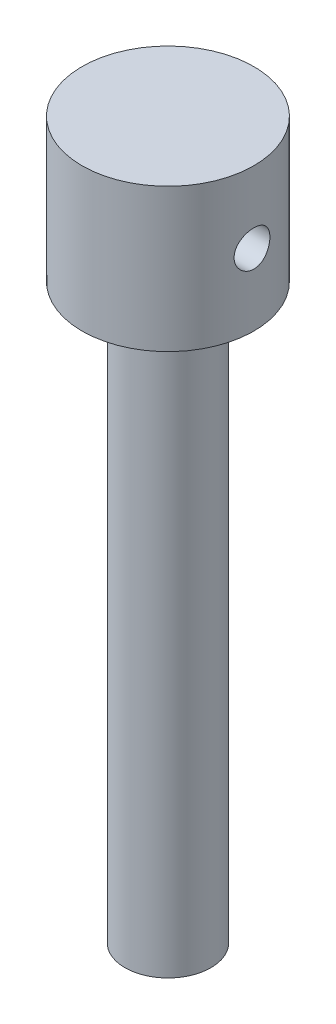
ISO-10303-21;
HEADER;
FILE_DESCRIPTION(('STEP AP214'),'2;1');
FILE_NAME('part.step','',(''),(''),'','','');
FILE_SCHEMA(('AUTOMOTIVE_DESIGN { 1 0 10303 214 1 1 1 1 }'));
ENDSEC;
DATA;
#1=APPLICATION_CONTEXT('core data for automotive mechanical design processes');
#2=APPLICATION_PROTOCOL_DEFINITION('international standard','automotive_design',2000,#1);
#3=PRODUCT_CONTEXT('',#1,'mechanical');
#4=PRODUCT('Part','Part','',(#3));
#5=PRODUCT_RELATED_PRODUCT_CATEGORY('part','',(#4));
#6=PRODUCT_DEFINITION_FORMATION('','',#4);
#7=PRODUCT_DEFINITION_CONTEXT('part definition',#1,'design');
#8=PRODUCT_DEFINITION('design','',#6,#7);
#9=PRODUCT_DEFINITION_SHAPE('','',#8);
#10=(LENGTH_UNIT() NAMED_UNIT(*) SI_UNIT(.MILLI.,.METRE.));
#11=(NAMED_UNIT(*) PLANE_ANGLE_UNIT() SI_UNIT($,.RADIAN.));
#12=(NAMED_UNIT(*) SI_UNIT($,.STERADIAN.) SOLID_ANGLE_UNIT());
#13=UNCERTAINTY_MEASURE_WITH_UNIT(LENGTH_MEASURE(1.E-05),#10,'distance_accuracy_value','');
#14=(GEOMETRIC_REPRESENTATION_CONTEXT(3) GLOBAL_UNCERTAINTY_ASSIGNED_CONTEXT((#13)) GLOBAL_UNIT_ASSIGNED_CONTEXT((#10,
#11,#12)) REPRESENTATION_CONTEXT('',''));
#15=CARTESIAN_POINT('',(0.,0.,0.));
#16=DIRECTION('',(0.,0.,1.));
#17=DIRECTION('',(1.,0.,0.));
#18=AXIS2_PLACEMENT_3D('',#15,#16,#17);
#19=CARTESIAN_POINT('',(0.,-2540.,0.));
#20=DIRECTION('',(0.,1.,0.));
#21=DIRECTION('',(0.,0.,1.));
#22=AXIS2_PLACEMENT_3D('',#19,#20,#21);
#23=CYLINDRICAL_SURFACE('',#22,152.4);
#24=CARTESIAN_POINT('',(0.,-2540.,0.));
#25=DIRECTION('',(0.,1.,0.));
#26=DIRECTION('',(0.,0.,1.));
#27=AXIS2_PLACEMENT_3D('',#24,#25,#26);
#28=CIRCLE('',#27,152.4);
#29=CARTESIAN_POINT('',(0.,-2540.,152.4));
#30=VERTEX_POINT('',#29);
#31=EDGE_CURVE('E45',#30,#30,#28,.T.);
#32=ORIENTED_EDGE('',*,*,#31,.T.);
#33=EDGE_LOOP('',(#32));
#34=FACE_BOUND('',#33,.T.);
#35=CARTESIAN_POINT('',(0.,-508.,0.));
#36=DIRECTION('',(0.,1.,0.));
#37=DIRECTION('',(0.,0.,1.));
#38=AXIS2_PLACEMENT_3D('',#35,#36,#37);
#39=CIRCLE('',#38,152.4);
#40=CARTESIAN_POINT('',(0.,-508.,152.4));
#41=VERTEX_POINT('',#40);
#42=EDGE_CURVE('E84',#41,#41,#39,.T.);
#43=ORIENTED_EDGE('',*,*,#42,.F.);
#44=EDGE_LOOP('',(#43));
#45=FACE_BOUND('',#44,.T.);
#46=ADVANCED_FACE('F31',(#34,#45),#23,.T.);
#47=CARTESIAN_POINT('',(0.,-2540.,0.));
#48=DIRECTION('',(0.,1.,0.));
#49=DIRECTION('',(0.,0.,1.));
#50=AXIS2_PLACEMENT_3D('',#47,#48,#49);
#51=PLANE('',#50);
#52=ORIENTED_EDGE('',*,*,#31,.F.);
#53=EDGE_LOOP('',(#52));
#54=FACE_BOUND('',#53,.T.);
#55=ADVANCED_FACE('F71',(#54),#51,.F.);
#56=CARTESIAN_POINT('',(0.,-508.,0.));
#57=DIRECTION('',(0.,1.,0.));
#58=DIRECTION('',(0.,0.,1.));
#59=AXIS2_PLACEMENT_3D('',#56,#57,#58);
#60=CYLINDRICAL_SURFACE('',#59,304.8);
#61=CARTESIAN_POINT('',(-304.8,-190.5,0.));
#62=CARTESIAN_POINT('',(-304.79999546431,-190.500009396525,-1.76319088101806));
#63=CARTESIAN_POINT('',(-304.784661423794,-190.573499805236,-3.52659064471798));
#64=CARTESIAN_POINT('',(-304.7237389634,-190.866908924895,-7.0408053402192));
#65=CARTESIAN_POINT('',(-304.678145685339,-191.086851149001,-8.79161820553385));
#66=CARTESIAN_POINT('',(-304.55793734996,-191.671602740303,-12.2691303318626));
#67=CARTESIAN_POINT('',(-304.483302324437,-192.036511785814,-13.9958121530954));
#68=CARTESIAN_POINT('',(-304.307091291084,-192.908283697848,-17.4114583656197));
#69=CARTESIAN_POINT('',(-304.205516310967,-193.415141149327,-19.1004241930465));
#70=CARTESIAN_POINT('',(-303.978346847667,-194.566312753073,-22.4272604962437));
#71=CARTESIAN_POINT('',(-303.852776457886,-195.210489100001,-24.0651803238746));
#72=CARTESIAN_POINT('',(-303.580989788483,-196.631771699244,-27.2805071656402));
#73=CARTESIAN_POINT('',(-303.434773333119,-197.408879083096,-28.857913664533));
#74=CARTESIAN_POINT('',(-303.125684333512,-199.090319106633,-31.9415205079078));
#75=CARTESIAN_POINT('',(-302.962812958324,-199.994642818311,-33.4477258393667));
#76=CARTESIAN_POINT('',(-302.624811555702,-201.924204451696,-36.3791245512785));
#77=CARTESIAN_POINT('',(-302.44968142027,-202.949443438694,-37.8043172178279));
#78=CARTESIAN_POINT('',(-302.089537409372,-205.128050140295,-40.5825007975992));
#79=CARTESIAN_POINT('',(-301.904424015116,-206.28292223428,-41.9342993055183));
#80=CARTESIAN_POINT('',(-301.531586946711,-208.701706318355,-44.5361619775687));
#81=CARTESIAN_POINT('',(-301.343863249758,-209.965619261536,-45.7862252522801));
#82=CARTESIAN_POINT('',(-300.971007755131,-212.594086769077,-48.1763000779754));
#83=CARTESIAN_POINT('',(-300.785876165944,-213.958649374125,-49.3163028196228));
#84=CARTESIAN_POINT('',(-300.423403746975,-216.779210781169,-51.478348559392));
#85=CARTESIAN_POINT('',(-300.246062943562,-218.235209892595,-52.5003911582925));
#86=CARTESIAN_POINT('',(-299.902486838079,-221.2438297114,-54.428923335988));
#87=CARTESIAN_POINT('',(-299.736379821278,-222.79726871107,-55.3341598572576));
#88=CARTESIAN_POINT('',(-299.422093114321,-225.976759870524,-57.0103295916951));
#89=CARTESIAN_POINT('',(-299.27391357706,-227.602812649435,-57.7812616594689));
#90=CARTESIAN_POINT('',(-298.999896352167,-230.915962150219,-59.182871102269));
#91=CARTESIAN_POINT('',(-298.874056794132,-232.6030537474,-59.8135602201755));
#92=CARTESIAN_POINT('',(-298.64850189146,-236.026295532956,-60.9297702867993));
#93=CARTESIAN_POINT('',(-298.548786122359,-237.762444923725,-61.4152935942025));
#94=CARTESIAN_POINT('',(-298.37973293341,-241.246220474984,-62.2313932554135));
#95=CARTESIAN_POINT('',(-298.309984983559,-242.993335210541,-62.5640681841885));
#96=CARTESIAN_POINT('',(-298.200934843699,-246.510246945483,-63.0817933749688));
#97=CARTESIAN_POINT('',(-298.161632393916,-248.280043751205,-63.2668448965536));
#98=CARTESIAN_POINT('',(-298.114666401822,-251.829170129456,-63.4877822160072));
#99=CARTESIAN_POINT('',(-298.106999775454,-253.608498755829,-63.5236825540666));
#100=CARTESIAN_POINT('',(-298.123530541776,-257.16373539915,-63.4460568242249));
#101=CARTESIAN_POINT('',(-298.147727642036,-258.93964344734,-63.3325321276779));
#102=CARTESIAN_POINT('',(-298.226593279147,-262.445851913452,-62.9601017243838));
#103=CARTESIAN_POINT('',(-298.280753705038,-264.176421885268,-62.70361972434));
#104=CARTESIAN_POINT('',(-298.417599983941,-267.609399417451,-62.0490744548074));
#105=CARTESIAN_POINT('',(-298.500285476483,-269.311807333416,-61.651012974453));
#106=CARTESIAN_POINT('',(-298.691793466412,-272.676707670412,-60.7163881086915));
#107=CARTESIAN_POINT('',(-298.800616888362,-274.339198677194,-60.1798198239041));
#108=CARTESIAN_POINT('',(-299.041290400602,-277.612890133795,-58.9722422193232));
#109=CARTESIAN_POINT('',(-299.173140748487,-279.2240900096,-58.3012313955589));
#110=CARTESIAN_POINT('',(-299.457184306052,-282.395926877639,-56.8243259317137));
#111=CARTESIAN_POINT('',(-299.609518483925,-283.956110943387,-56.0174858505981));
#112=CARTESIAN_POINT('',(-299.929493597757,-287.00313784371,-54.278175859938));
#113=CARTESIAN_POINT('',(-300.097134577089,-288.489980470451,-53.3457055944116));
#114=CARTESIAN_POINT('',(-300.443089113583,-291.380738675458,-51.3615039447819));
#115=CARTESIAN_POINT('',(-300.621403782693,-292.78464558339,-50.3097601249256));
#116=CARTESIAN_POINT('',(-300.983802286802,-295.500246955072,-48.0941830383966));
#117=CARTESIAN_POINT('',(-301.167886198813,-296.811940187145,-46.9303482750447));
#118=CARTESIAN_POINT('',(-301.540438255713,-299.359285152686,-44.4744447877942));
#119=CARTESIAN_POINT('',(-301.728921665549,-300.592944900083,-43.1803112861641));
#120=CARTESIAN_POINT('',(-302.101400619181,-302.947089171871,-40.4922761575834));
#121=CARTESIAN_POINT('',(-302.285396102,-304.067572159148,-39.0983731760499));
#122=CARTESIAN_POINT('',(-302.643751376438,-306.187566924451,-36.2201937977888));
#123=CARTESIAN_POINT('',(-302.818110958479,-307.187076071894,-34.7359154368976));
#124=CARTESIAN_POINT('',(-303.152302244584,-309.057931561135,-31.6871101079079));
#125=CARTESIAN_POINT('',(-303.312134018023,-309.92927851497,-30.1225835230818));
#126=CARTESIAN_POINT('',(-303.613045855548,-311.538840214011,-26.9211369238498));
#127=CARTESIAN_POINT('',(-303.754091303969,-312.276810067555,-25.2840904802059));
#128=CARTESIAN_POINT('',(-304.013078678416,-313.612005807361,-21.9517761002836));
#129=CARTESIAN_POINT('',(-304.131020524307,-314.20923120545,-20.2565079620869));
#130=CARTESIAN_POINT('',(-304.340411797307,-315.258146921947,-16.8201160878689));
#131=CARTESIAN_POINT('',(-304.431864066249,-315.70985285244,-15.0789972926401));
#132=CARTESIAN_POINT('',(-304.585654424506,-316.464129239723,-11.5634907927455));
#133=CARTESIAN_POINT('',(-304.647993002235,-316.766702198385,-9.78910364671211));
#134=CARTESIAN_POINT('',(-304.74090223559,-317.216096853701,-6.25257331044987));
#135=CARTESIAN_POINT('',(-304.772027539084,-317.36563887171,-4.4907899370687));
#136=CARTESIAN_POINT('',(-304.803597048986,-317.517307547158,-0.960623463977809));
#137=CARTESIAN_POINT('',(-304.804041624962,-317.519435980292,0.807759555978171));
#138=CARTESIAN_POINT('',(-304.774238263711,-317.37626651585,4.33817942702701));
#139=CARTESIAN_POINT('',(-304.743992081751,-317.230977049407,6.10021663526628));
#140=CARTESIAN_POINT('',(-304.653658955661,-316.794167623845,9.60528908998855));
#141=CARTESIAN_POINT('',(-304.593572077987,-316.502647990385,11.3483243787804));
#142=CARTESIAN_POINT('',(-304.445971814752,-315.779313863985,14.7858344688643));
#143=CARTESIAN_POINT('',(-304.358734849735,-315.348911803583,16.480618695463));
#144=CARTESIAN_POINT('',(-304.159035050537,-314.35037449013,19.8275582843945));
#145=CARTESIAN_POINT('',(-304.046572435354,-313.782240432799,21.4797140166687));
#146=CARTESIAN_POINT('',(-303.79945816808,-312.512463245521,24.7302749652146));
#147=CARTESIAN_POINT('',(-303.664805196469,-311.810812175778,26.3286769782822));
#148=CARTESIAN_POINT('',(-303.376933906985,-310.279121708545,29.4609904008485));
#149=CARTESIAN_POINT('',(-303.223715336586,-309.449080564668,30.9949009327604));
#150=CARTESIAN_POINT('',(-302.900696824637,-307.654737621275,34.0078480863476));
#151=CARTESIAN_POINT('',(-302.730705520281,-306.688815504386,35.4858992885779));
#152=CARTESIAN_POINT('',(-302.380507508335,-304.637948370907,38.3556870097999));
#153=CARTESIAN_POINT('',(-302.200300725084,-303.5530024727,39.7474228893292));
#154=CARTESIAN_POINT('',(-301.834564086957,-301.27136382232,42.4355564409283));
#155=CARTESIAN_POINT('',(-301.649033688061,-300.07465962121,43.7319443208236));
#156=CARTESIAN_POINT('',(-301.277732133057,-297.577584876574,46.2206824140913));
#157=CARTESIAN_POINT('',(-301.091960974667,-296.277213342743,47.4130316333858));
#158=CARTESIAN_POINT('',(-300.722225581546,-293.558937695268,49.7046559397129));
#159=CARTESIAN_POINT('',(-300.538342809611,-292.139438294097,50.8020528306096));
#160=CARTESIAN_POINT('',(-300.180862537653,-289.211796685258,52.8733846027781));
#161=CARTESIAN_POINT('',(-300.007265166316,-287.703653369001,53.8473179395213));
#162=CARTESIAN_POINT('',(-299.675391999181,-284.609092685712,55.66464805008));
#163=CARTESIAN_POINT('',(-299.517115805619,-283.022677352372,56.5080482131023));
#164=CARTESIAN_POINT('',(-299.220534572409,-279.782559442561,58.0580288771664));
#165=CARTESIAN_POINT('',(-299.082229321945,-278.128857576611,58.7646108225049));
#166=CARTESIAN_POINT('',(-298.830406764066,-274.775045141324,60.0320205162907));
#167=CARTESIAN_POINT('',(-298.71675817714,-273.075237430417,60.5936233767495));
#168=CARTESIAN_POINT('',(-298.516701803343,-269.632769141104,61.5716510666526));
#169=CARTESIAN_POINT('',(-298.430293966181,-267.890108641818,61.9880761641187));
#170=CARTESIAN_POINT('',(-298.287351347017,-264.374850213078,62.6723095717683));
#171=CARTESIAN_POINT('',(-298.230812974977,-262.602255907836,62.9401357423843));
#172=CARTESIAN_POINT('',(-298.149328213561,-259.04006075432,63.3250106603086));
#173=CARTESIAN_POINT('',(-298.124381331757,-257.250460171567,63.4420617578025));
#174=CARTESIAN_POINT('',(-298.107018272599,-253.703031628898,63.5235955410591));
#175=CARTESIAN_POINT('',(-298.113969297562,-251.945274273884,63.4910460166657));
#176=CARTESIAN_POINT('',(-298.158753978519,-248.438918285584,63.2803998101877));
#177=CARTESIAN_POINT('',(-298.196587203597,-246.690319524845,63.1023051589748));
#178=CARTESIAN_POINT('',(-298.302016552141,-243.214811519075,62.6020134520459));
#179=CARTESIAN_POINT('',(-298.369612216181,-241.487901939664,62.2798186207202));
#180=CARTESIAN_POINT('',(-298.532582403127,-238.067943278655,61.4938864169661));
#181=CARTESIAN_POINT('',(-298.62795704614,-236.374894343493,61.0301484325478));
#182=CARTESIAN_POINT('',(-298.843405146736,-233.039244757841,59.9662621081544));
#183=CARTESIAN_POINT('',(-298.963406713604,-231.396512912225,59.3665102949352));
#184=CARTESIAN_POINT('',(-299.22485791886,-228.167550594977,58.0343417295083));
#185=CARTESIAN_POINT('',(-299.366307470327,-226.5813198944,57.3019255149342));
#186=CARTESIAN_POINT('',(-299.6666974544,-223.475768639069,55.709662434276));
#187=CARTESIAN_POINT('',(-299.82563911505,-221.956452792617,54.8498066197342));
#188=CARTESIAN_POINT('',(-300.156612207752,-218.99474481419,53.0087030011673));
#189=CARTESIAN_POINT('',(-300.328643833693,-217.552353822177,52.0274533989048));
#190=CARTESIAN_POINT('',(-300.684349642264,-214.728038468814,49.9310775542183));
#191=CARTESIAN_POINT('',(-300.868179819404,-213.347715339226,48.8138199266966));
#192=CARTESIAN_POINT('',(-301.23940826588,-210.685698271514,46.4679326292759));
#193=CARTESIAN_POINT('',(-301.426806585433,-209.40400572274,45.2393013910555));
#194=CARTESIAN_POINT('',(-301.800012552535,-206.947560971907,42.6786414466894));
#195=CARTESIAN_POINT('',(-301.985819826361,-205.772833302877,41.3465891494516));
#196=CARTESIAN_POINT('',(-302.350662597825,-203.538646651409,38.5882343706313));
#197=CARTESIAN_POINT('',(-302.529698139565,-202.479186918217,37.1619325030037));
#198=CARTESIAN_POINT('',(-302.878054813983,-200.471360564936,34.2076194378895));
#199=CARTESIAN_POINT('',(-303.047239954756,-199.524417491538,32.6786242332295));
#200=CARTESIAN_POINT('',(-303.368836488638,-197.762901351158,29.5443798002959));
#201=CARTESIAN_POINT('',(-303.521247002184,-196.948335224179,27.9391265798125));
#202=CARTESIAN_POINT('',(-303.804829667349,-195.458397658806,24.6650234359154));
#203=CARTESIAN_POINT('',(-303.936018544255,-194.782916488479,22.996224888338));
#204=CARTESIAN_POINT('',(-304.173526852728,-193.575706042639,19.6058970983133));
#205=CARTESIAN_POINT('',(-304.279850921032,-193.043949962689,17.8843777549536));
#206=CARTESIAN_POINT('',(-304.441927857516,-192.240701723642,14.8285818804919));
#207=CARTESIAN_POINT('',(-304.503688130904,-191.937363687571,13.5028931197459));
#208=CARTESIAN_POINT('',(-304.610328305448,-191.416236367081,10.833807161565));
#209=CARTESIAN_POINT('',(-304.655205074838,-191.198462953939,9.49040672653163));
#210=CARTESIAN_POINT('',(-304.727305726364,-190.849623721103,6.79196195200822));
#211=CARTESIAN_POINT('',(-304.754530115667,-190.718555410299,5.43691794818099));
#212=CARTESIAN_POINT('',(-304.790877251693,-190.543748371276,2.72129001558814));
#213=CARTESIAN_POINT('',(-304.800003500328,-190.49999274842,1.36070720962217));
#214=CARTESIAN_POINT('',(-304.8,-190.5,0.));
#215=B_SPLINE_CURVE_WITH_KNOTS('',3,(#61,#62,#63,#64,#65,#66,#67,#68,#69,#70,#71,#72,#73,#74,
#75,#76,#77,#78,#79,#80,#81,#82,#83,#84,#85,#86,#87,#88,#89,#90,#91,#92,#93,#94,#95,#96,#97,#98,
#99,#100,#101,#102,#103,#104,#105,#106,#107,#108,#109,#110,#111,#112,#113,#114,#115,#116,#117,
#118,#119,#120,#121,#122,#123,#124,#125,#126,#127,#128,#129,#130,#131,#132,#133,#134,#135,#136,
#137,#138,#139,#140,#141,#142,#143,#144,#145,#146,#147,#148,#149,#150,#151,#152,#153,#154,#155,
#156,#157,#158,#159,#160,#161,#162,#163,#164,#165,#166,#167,#168,#169,#170,#171,#172,#173,#174,
#175,#176,#177,#178,#179,#180,#181,#182,#183,#184,#185,#186,#187,#188,#189,#190,#191,#192,#193,
#194,#195,#196,#197,#198,#199,#200,#201,#202,#203,#204,#205,#206,#207,#208,#209,#210,#211,#212,
#213,#214),.UNSPECIFIED.,.T.,.F.,(4,2,2,2,2,2,2,2,2,2,2,2,2,2,2,2,2,2,2,2,2,2,2,2,2,2,2,2,2,2,2,
2,2,2,2,2,2,2,2,2,2,2,2,2,2,2,2,2,2,2,2,2,2,2,2,2,2,2,2,2,2,2,2,2,2,2,2,2,2,2,2,2,2,2,2,2,4),
(0.,5.28834150359224,10.5775322667386,15.8703661577895,21.1629981654704,26.4503435886304,
31.7377340210111,37.0247535706949,42.3118197036704,47.6682421880014,53.0247114958108,
58.3816091850422,63.7385250034869,69.1488257039548,74.5591725430464,79.9690661900299,
85.3788719311028,90.7120029332779,96.0450884306506,101.377654013279,106.710170656417,
111.954914867784,117.199592803878,122.444456284603,127.68937844141,132.972443780852,
138.255524090544,143.539155734425,148.822857937066,154.210024206108,159.597263631263,
164.984620181233,170.371951003122,175.769075098994,181.166217914501,186.562781503464,
191.959254555932,197.258038422866,202.556758462411,207.855175474314,213.153580686574,
218.399715187765,223.645804146287,228.892205169234,234.138677561021,239.454062796155,
244.769487405327,250.08545714493,255.401477672479,260.805928488453,266.210446907415,
271.614824978106,277.01914599535,282.393945386615,287.768734855073,293.142878175721,
298.516937726636,303.784851575247,309.052691918992,314.320450948969,319.588232755471,
324.840850224666,330.09344640766,335.346411588384,340.599454591958,345.94916792162,
351.298956595651,356.649969200913,362.000946952372,367.413692444293,372.826721613669,
378.235463636924,383.643196243634,387.724518288523,391.806597015835,395.888558456469,
399.96972997814),.UNSPECIFIED.);
#216=CARTESIAN_POINT('',(-304.8,-190.5,0.));
#217=VERTEX_POINT('',#216);
#218=EDGE_CURVE('E10',#217,#217,#215,.T.);
#219=ORIENTED_EDGE('',*,*,#218,.F.);
#220=EDGE_LOOP('',(#219));
#221=FACE_BOUND('',#220,.T.);
#222=CARTESIAN_POINT('',(298.11204269536,-254.,-63.5));
#223=CARTESIAN_POINT('',(298.112047586021,-252.237276557658,-63.4999905656212));
#224=CARTESIAN_POINT('',(298.127719614356,-250.474343899826,-63.4265388112721));
#225=CARTESIAN_POINT('',(298.189956077456,-246.961076474877,-63.133287585739));
#226=CARTESIAN_POINT('',(298.236525483282,-245.210743780776,-62.9134645649445));
#227=CARTESIAN_POINT('',(298.359213128618,-241.734201455444,-62.3290388836539));
#228=CARTESIAN_POINT('',(298.435351864611,-240.008009419469,-61.9643357930546));
#229=CARTESIAN_POINT('',(298.614926056332,-236.593354218464,-61.0930720887787));
#230=CARTESIAN_POINT('',(298.718360477171,-234.904889625669,-60.5865168532378));
#231=CARTESIAN_POINT('',(298.949387920351,-231.579119758577,-59.436074880553));
#232=CARTESIAN_POINT('',(299.076955625902,-229.941762948524,-58.7923319700939));
#233=CARTESIAN_POINT('',(299.352658453054,-226.727515191952,-57.3720213978035));
#234=CARTESIAN_POINT('',(299.500793749823,-225.150624760552,-56.5954526047232));
#235=CARTESIAN_POINT('',(299.813431306713,-222.067960700783,-54.9151731073403));
#236=CARTESIAN_POINT('',(299.977932482069,-220.562182368697,-54.0114708280721));
#237=CARTESIAN_POINT('',(300.318726471391,-217.631523139554,-52.0832097611686));
#238=CARTESIAN_POINT('',(300.495019393641,-216.206642985619,-51.0586498636142));
#239=CARTESIAN_POINT('',(300.857024428059,-213.4280523606,-48.8807298014753));
#240=CARTESIAN_POINT('',(301.042832816675,-212.075592110777,-47.7257902913964));
#241=CARTESIAN_POINT('',(301.416385709994,-209.472398151188,-45.3067309700195));
#242=CARTESIAN_POINT('',(301.604130232228,-208.221665363393,-44.0426101694092));
#243=CARTESIAN_POINT('',(301.976351012044,-205.830278035469,-41.4135930043779));
#244=CARTESIAN_POINT('',(302.160827035154,-204.689631366676,-40.0486894461242));
#245=CARTESIAN_POINT('',(302.521386549113,-202.526344973037,-37.227313134513));
#246=CARTESIAN_POINT('',(302.697470016713,-201.503705575102,-35.7708401275017));
#247=CARTESIAN_POINT('',(303.037978576212,-199.574482943373,-32.7618273689545));
#248=CARTESIAN_POINT('',(303.20227673123,-198.669097161893,-31.2085051053933));
#249=CARTESIAN_POINT('',(303.512689606608,-196.992617386016,-28.0292330493021));
#250=CARTESIAN_POINT('',(303.65880417594,-196.221524507008,-26.4032826536898));
#251=CARTESIAN_POINT('',(303.928672090997,-194.81958820186,-23.090340002662));
#252=CARTESIAN_POINT('',(304.052427193488,-194.188733756406,-21.4033525553876));
#253=CARTESIAN_POINT('',(304.274034648678,-193.072191469147,-17.9803474055727));
#254=CARTESIAN_POINT('',(304.371887413039,-192.58650132026,-16.2443304827327));
#255=CARTESIAN_POINT('',(304.537671615978,-191.770095671966,-12.7610061186957));
#256=CARTESIAN_POINT('',(304.606009858056,-191.437268875647,-11.0142127478747));
#257=CARTESIAN_POINT('',(304.712838591487,-190.919191394395,-7.49797037914123));
#258=CARTESIAN_POINT('',(304.751329338665,-190.733939444586,-5.72852157554235));
#259=CARTESIAN_POINT('',(304.797367664776,-190.512543766122,-2.18008017011948));
#260=CARTESIAN_POINT('',(304.804918066674,-190.476386434223,-0.401088453811917));
#261=CARTESIAN_POINT('',(304.788868146917,-190.55344309168,3.15350734998482));
#262=CARTESIAN_POINT('',(304.765268089397,-190.666655814476,4.92911146607076));
#263=CARTESIAN_POINT('',(304.688192321451,-191.03860786613,8.43652843214046));
#264=CARTESIAN_POINT('',(304.635184456717,-191.295068700239,10.168593786058));
#265=CARTESIAN_POINT('',(304.501086509387,-191.949824765035,13.6045716218126));
#266=CARTESIAN_POINT('',(304.419996764821,-192.348118288437,15.3084844422724));
#267=CARTESIAN_POINT('',(304.231948465216,-193.283460822415,18.6763587842036));
#268=CARTESIAN_POINT('',(304.124989200204,-193.820513641186,20.3403192078275));
#269=CARTESIAN_POINT('',(303.888106348167,-195.02931070515,23.6168831792986));
#270=CARTESIAN_POINT('',(303.758182522017,-195.701056352876,25.2294861921675));
#271=CARTESIAN_POINT('',(303.477930853559,-197.179278047847,28.4031785816857));
#272=CARTESIAN_POINT('',(303.327471414357,-197.986631500164,29.963847594179));
#273=CARTESIAN_POINT('',(303.010910224336,-199.727045466497,33.011758411533));
#274=CARTESIAN_POINT('',(302.844808432897,-200.660106306962,34.4990000256972));
#275=CARTESIAN_POINT('',(302.501429870733,-202.645537454078,37.3904412834765));
#276=CARTESIAN_POINT('',(302.324151935461,-203.697920203148,38.794632243623));
#277=CARTESIAN_POINT('',(301.963212190093,-205.914791787734,41.5106699363294));
#278=CARTESIAN_POINT('',(301.77955029596,-207.079282099376,42.8225154525791));
#279=CARTESIAN_POINT('',(301.407305799706,-209.535687028795,45.3691917977736));
#280=CARTESIAN_POINT('',(301.218695834006,-210.829595313699,46.6020964474988));
#281=CARTESIAN_POINT('',(300.845294125895,-213.51702456097,48.9547557066438));
#282=CARTESIAN_POINT('',(300.660502433868,-214.910546836702,50.0745088237412));
#283=CARTESIAN_POINT('',(300.299973736461,-217.787833533687,52.19311108186));
#284=CARTESIAN_POINT('',(300.124236988777,-219.271600520626,53.1919567830266));
#285=CARTESIAN_POINT('',(299.786866491383,-222.319273007576,55.0615785922818));
#286=CARTESIAN_POINT('',(299.625232683784,-223.883178178595,55.9323552260729));
#287=CARTESIAN_POINT('',(299.320387732896,-227.084407970444,57.5414469928579));
#288=CARTESIAN_POINT('',(299.177223746289,-228.721906671803,58.2794248908082));
#289=CARTESIAN_POINT('',(298.914044242588,-232.055166222143,59.614574767936));
#290=CARTESIAN_POINT('',(298.794028813739,-233.750927293198,60.2117462103478));
#291=CARTESIAN_POINT('',(298.580776569552,-237.188337327557,61.2604806285617));
#292=CARTESIAN_POINT('',(298.48753662871,-238.929980909063,61.7120606000177));
#293=CARTESIAN_POINT('',(298.33066655527,-242.446577321862,62.4660064987016));
#294=CARTESIAN_POINT('',(298.267035901556,-244.221529566361,62.7683750520145));
#295=CARTESIAN_POINT('',(298.172232931501,-247.758404992897,63.217174171273));
#296=CARTESIAN_POINT('',(298.140480511805,-249.519959279874,63.3663928442274));
#297=CARTESIAN_POINT('',(298.10833425734,-253.04965275014,63.517455168425));
#298=CARTESIAN_POINT('',(298.107940036995,-254.817791852197,63.5193006317457));
#299=CARTESIAN_POINT('',(298.138520906279,-258.347688510384,63.3756079053134));
#300=CARTESIAN_POINT('',(298.169494180238,-260.109446429958,63.2300782462009));
#301=CARTESIAN_POINT('',(298.261879895248,-263.613911399636,62.7928403780026));
#302=CARTESIAN_POINT('',(298.323292262408,-265.356618495976,62.5011325237703));
#303=CARTESIAN_POINT('',(298.473926272945,-268.792193621313,61.7777473019816));
#304=CARTESIAN_POINT('',(298.562846913506,-270.485393833579,61.3475829946507));
#305=CARTESIAN_POINT('',(298.766132215824,-273.829194248999,60.3497904050762));
#306=CARTESIAN_POINT('',(298.880496644785,-275.479794841761,59.7821633805362));
#307=CARTESIAN_POINT('',(299.131425312449,-278.727334511295,58.5136573274296));
#308=CARTESIAN_POINT('',(299.26799104219,-280.324269975221,57.8127693485255));
#309=CARTESIAN_POINT('',(299.559488981723,-283.453779755471,56.2828448013788));
#310=CARTESIAN_POINT('',(299.714421457046,-284.986353140871,55.4538063803982));
#311=CARTESIAN_POINT('',(300.04065272763,-287.998179299892,53.6608633097643));
#312=CARTESIAN_POINT('',(300.212151055048,-289.476379025189,52.6952258702248));
#313=CARTESIAN_POINT('',(300.564830123931,-292.346524700541,50.6448867942349));
#314=CARTESIAN_POINT('',(300.746010941791,-293.738469969863,49.5601842182896));
#315=CARTESIAN_POINT('',(301.113057152303,-296.427081492948,47.2789718748845));
#316=CARTESIAN_POINT('',(301.298923003249,-297.723738376599,46.0824511380787));
#317=CARTESIAN_POINT('',(301.670221773154,-300.213070285812,43.5856616313003));
#318=CARTESIAN_POINT('',(301.855654688082,-301.405744346509,42.2853918988462));
#319=CARTESIAN_POINT('',(302.224094535463,-303.698240072637,39.5670184667522));
#320=CARTESIAN_POINT('',(302.407008430454,-304.796166051775,38.1473026211804));
#321=CARTESIAN_POINT('',(302.761999403312,-306.868524380871,35.2191199269063));
#322=CARTESIAN_POINT('',(302.934076344278,-307.842955170901,33.7106519574862));
#323=CARTESIAN_POINT('',(303.262528294313,-309.661215869916,30.615365521213));
#324=CARTESIAN_POINT('',(303.418903751376,-310.505049505473,29.0285492917221));
#325=CARTESIAN_POINT('',(303.711519970649,-312.05581383304,25.7875851135493));
#326=CARTESIAN_POINT('',(303.847760952221,-312.762746016602,24.1334378986814));
#327=CARTESIAN_POINT('',(304.095465802775,-314.030380756285,20.779735565001));
#328=CARTESIAN_POINT('',(304.207074850941,-314.591943700121,19.0805164581298));
#329=CARTESIAN_POINT('',(304.403387902523,-315.569979062164,15.6392851977274));
#330=CARTESIAN_POINT('',(304.48809196376,-315.986451792172,13.8972731361679));
#331=CARTESIAN_POINT('',(304.628162800493,-316.670885804942,10.3833401852389));
#332=CARTESIAN_POINT('',(304.683532795277,-316.938863384555,8.6114225999043));
#333=CARTESIAN_POINT('',(304.76335511663,-317.324152520746,5.05059827920506));
#334=CARTESIAN_POINT('',(304.787807894448,-317.441466276328,3.26169179218463));
#335=CARTESIAN_POINT('',(304.804929901073,-317.523670590007,-0.285929677255021));
#336=CARTESIAN_POINT('',(304.798190738858,-317.491398288953,-2.04457670666833));
#337=CARTESIAN_POINT('',(304.754465507661,-317.28115685287,-5.5527427426767));
#338=CARTESIAN_POINT('',(304.717479845751,-317.103189678678,-7.30226187180076));
#339=CARTESIAN_POINT('',(304.614289480321,-316.602995966884,-10.7796321234036));
#340=CARTESIAN_POINT('',(304.548085359773,-316.280772307514,-12.5074836774906));
#341=CARTESIAN_POINT('',(304.388288101098,-315.494616698825,-15.9293423818588));
#342=CARTESIAN_POINT('',(304.294694853409,-315.030684182642,-17.6233493967259));
#343=CARTESIAN_POINT('',(304.08297626773,-313.966136941373,-20.9612239416566));
#344=CARTESIAN_POINT('',(303.964917515,-313.365892785333,-22.6052139523844));
#345=CARTESIAN_POINT('',(303.707320230645,-312.032525120504,-25.8366220285743));
#346=CARTESIAN_POINT('',(303.567781782087,-311.299402125591,-27.4240403127849));
#347=CARTESIAN_POINT('',(303.270974364492,-309.705535649225,-30.5318397903409));
#348=CARTESIAN_POINT('',(303.113704241309,-308.844783859326,-32.0522166110195));
#349=CARTESIAN_POINT('',(302.785652130977,-307.00172768523,-35.0158827184937));
#350=CARTESIAN_POINT('',(302.614869952878,-306.019421583143,-36.4591709154068));
#351=CARTESIAN_POINT('',(302.261300592387,-303.921845816629,-39.2836763919193));
#352=CARTESIAN_POINT('',(302.078356298553,-302.804561123497,-40.6633779567967));
#353=CARTESIAN_POINT('',(301.708243709034,-300.458749488156,-43.3241309436958));
#354=CARTESIAN_POINT('',(301.521075356214,-299.230221040578,-44.605181030314));
#355=CARTESIAN_POINT('',(301.147648458638,-296.669896504006,-47.0603486731298));
#356=CARTESIAN_POINT('',(300.961390139246,-295.338076089224,-48.2344408977639));
#357=CARTESIAN_POINT('',(300.595016009414,-292.580318404562,-50.4673839158415));
#358=CARTESIAN_POINT('',(300.414900162544,-291.154381693013,-51.5262353928352));
#359=CARTESIAN_POINT('',(300.063797188226,-288.200409738863,-53.5332438713246));
#360=CARTESIAN_POINT('',(299.892944057915,-286.671362166417,-54.479935091241));
#361=CARTESIAN_POINT('',(299.567685497394,-283.537048734105,-56.2409464678703));
#362=CARTESIAN_POINT('',(299.41328093511,-281.931778858747,-57.055259640712));
#363=CARTESIAN_POINT('',(299.125614312136,-278.657660438534,-58.5447008960016));
#364=CARTESIAN_POINT('',(298.992335485718,-276.988863627448,-59.2199394790348));
#365=CARTESIAN_POINT('',(298.750791401834,-273.598525841198,-60.4266829499662));
#366=CARTESIAN_POINT('',(298.642521457372,-271.876994817734,-60.9582147736047));
#367=CARTESIAN_POINT('',(298.477390541133,-268.821789272779,-61.7609138541554));
#368=CARTESIAN_POINT('',(298.414434378129,-267.496719110904,-62.0639649561492));
#369=CARTESIAN_POINT('',(298.305679486304,-264.828870093703,-62.5846038674287));
#370=CARTESIAN_POINT('',(298.259883934471,-263.486088006909,-62.8021758521086));
#371=CARTESIAN_POINT('',(298.186286794731,-260.788879812861,-63.1506939939862));
#372=CARTESIAN_POINT('',(298.158484639833,-259.434454073874,-63.2816428807722));
#373=CARTESIAN_POINT('',(298.121362491071,-256.720059659467,-63.4562910841864));
#374=CARTESIAN_POINT('',(298.112038921795,-255.36009210737,-63.5000072794313));
#375=CARTESIAN_POINT('',(298.11204269536,-254.,-63.5));
#376=B_SPLINE_CURVE_WITH_KNOTS('',3,(#222,#223,#224,#225,#226,#227,#228,#229,#230,#231,#232,
#233,#234,#235,#236,#237,#238,#239,#240,#241,#242,#243,#244,#245,#246,#247,#248,#249,#250,#251,
#252,#253,#254,#255,#256,#257,#258,#259,#260,#261,#262,#263,#264,#265,#266,#267,#268,#269,#270,
#271,#272,#273,#274,#275,#276,#277,#278,#279,#280,#281,#282,#283,#284,#285,#286,#287,#288,#289,
#290,#291,#292,#293,#294,#295,#296,#297,#298,#299,#300,#301,#302,#303,#304,#305,#306,#307,#308,
#309,#310,#311,#312,#313,#314,#315,#316,#317,#318,#319,#320,#321,#322,#323,#324,#325,#326,#327,
#328,#329,#330,#331,#332,#333,#334,#335,#336,#337,#338,#339,#340,#341,#342,#343,#344,#345,#346,
#347,#348,#349,#350,#351,#352,#353,#354,#355,#356,#357,#358,#359,#360,#361,#362,#363,#364,#365,
#366,#367,#368,#369,#370,#371,#372,#373,#374,#375),.UNSPECIFIED.,.T.,.F.,(4,2,2,2,2,2,2,2,2,2,2,
2,2,2,2,2,2,2,2,2,2,2,2,2,2,2,2,2,2,2,2,2,2,2,2,2,2,2,2,2,2,2,2,2,2,2,2,2,2,2,2,2,2,2,2,2,2,2,2,
2,2,2,2,2,2,2,2,2,2,2,2,2,2,2,2,2,4),(0.,5.2869381593958,10.5747271376169,15.8661879974287,
21.1574482656828,26.4431882631752,31.7289732803976,37.0144081777288,42.2998916186413,
47.6581580367705,53.0164730122584,58.3751708325383,63.733883497447,69.1436077623434,
74.553376956322,79.9627209242588,85.3719789174699,90.7040962024942,96.036167785017,
101.367752863882,106.699292734714,111.948349963776,117.197344010402,122.446482128888,
127.695674908562,132.980240480052,138.264819775241,143.549950633237,148.835151090308,
154.22032520224,159.605570328392,164.990968630501,170.376344825817,175.775209610966,
181.174094976697,186.572349873915,191.970509759761,197.26855231362,202.566529723577,
207.864200483697,213.161858383575,218.40348409879,223.645061857999,228.886991786927,
234.128997508268,239.444727353029,244.760499145076,250.076792962103,255.39313610424,
260.798759642698,266.204451455346,271.609988988836,277.015467625259,282.388181315033,
287.760883458629,293.132995849106,298.505029830408,303.775595964701,309.046091166216,
314.316481214553,319.586892345819,324.843143610222,330.099374547845,335.355947808744,
340.612595367668,345.960648238885,351.308773491716,356.658162102508,362.007518981686,
367.420477045204,372.833720587643,378.242646346629,383.650557577247,387.730046418433,
391.810290133082,395.890405268673,399.969730867925),.UNSPECIFIED.);
#377=CARTESIAN_POINT('',(298.11204269536,-254.,-63.5));
#378=VERTEX_POINT('',#377);
#379=EDGE_CURVE('E41',#378,#378,#376,.T.);
#380=ORIENTED_EDGE('',*,*,#379,.F.);
#381=EDGE_LOOP('',(#380));
#382=FACE_BOUND('',#381,.T.);
#383=CARTESIAN_POINT('',(0.,-508.,0.));
#384=DIRECTION('',(0.,1.,0.));
#385=DIRECTION('',(0.,0.,1.));
#386=AXIS2_PLACEMENT_3D('',#383,#384,#385);
#387=CIRCLE('',#386,304.8);
#388=CARTESIAN_POINT('',(0.,-508.,304.8));
#389=VERTEX_POINT('',#388);
#390=EDGE_CURVE('E49',#389,#389,#387,.T.);
#391=ORIENTED_EDGE('',*,*,#390,.T.);
#392=EDGE_LOOP('',(#391));
#393=FACE_BOUND('',#392,.T.);
#394=CARTESIAN_POINT('',(0.,0.,0.));
#395=DIRECTION('',(0.,1.,0.));
#396=DIRECTION('',(0.,0.,1.));
#397=AXIS2_PLACEMENT_3D('',#394,#395,#396);
#398=CIRCLE('',#397,304.8);
#399=CARTESIAN_POINT('',(0.,0.,304.8));
#400=VERTEX_POINT('',#399);
#401=EDGE_CURVE('E85',#400,#400,#398,.T.);
#402=ORIENTED_EDGE('',*,*,#401,.F.);
#403=EDGE_LOOP('',(#402));
#404=FACE_BOUND('',#403,.T.);
#405=ADVANCED_FACE('F54',(#221,#382,#393,#404),#60,.T.);
#406=CARTESIAN_POINT('',(0.,-508.,0.));
#407=DIRECTION('',(0.,1.,0.));
#408=DIRECTION('',(0.,0.,1.));
#409=AXIS2_PLACEMENT_3D('',#406,#407,#408);
#410=PLANE('',#409);
#411=ORIENTED_EDGE('',*,*,#42,.T.);
#412=EDGE_LOOP('',(#411));
#413=FACE_BOUND('',#412,.T.);
#414=ORIENTED_EDGE('',*,*,#390,.F.);
#415=EDGE_LOOP('',(#414));
#416=FACE_BOUND('',#415,.T.);
#417=ADVANCED_FACE('F62',(#413,#416),#410,.F.);
#418=CARTESIAN_POINT('',(0.,0.,0.));
#419=DIRECTION('',(0.,1.,0.));
#420=DIRECTION('',(0.,0.,1.));
#421=AXIS2_PLACEMENT_3D('',#418,#419,#420);
#422=PLANE('',#421);
#423=ORIENTED_EDGE('',*,*,#401,.T.);
#424=EDGE_LOOP('',(#423));
#425=FACE_BOUND('',#424,.T.);
#426=ADVANCED_FACE('F61',(#425),#422,.T.);
#427=CARTESIAN_POINT('',(-304.8,-254.,0.));
#428=DIRECTION('',(1.,0.,0.));
#429=DIRECTION('',(0.,0.,-1.));
#430=AXIS2_PLACEMENT_3D('',#427,#428,#429);
#431=CYLINDRICAL_SURFACE('',#430,63.5);
#432=ORIENTED_EDGE('',*,*,#218,.T.);
#433=EDGE_LOOP('',(#432));
#434=FACE_BOUND('',#433,.T.);
#435=ORIENTED_EDGE('',*,*,#379,.T.);
#436=EDGE_LOOP('',(#435));
#437=FACE_BOUND('',#436,.T.);
#438=ADVANCED_FACE('F58',(#434,#437),#431,.F.);
#439=CLOSED_SHELL('',(#46,#55,#405,#417,#426,#438));
#440=MANIFOLD_SOLID_BREP('B2',#439);
#441=ADVANCED_BREP_SHAPE_REPRESENTATION('',(#18,#440),#14);
#442=SHAPE_DEFINITION_REPRESENTATION(#9,#441);
ENDSEC;
END-ISO-10303-21;
